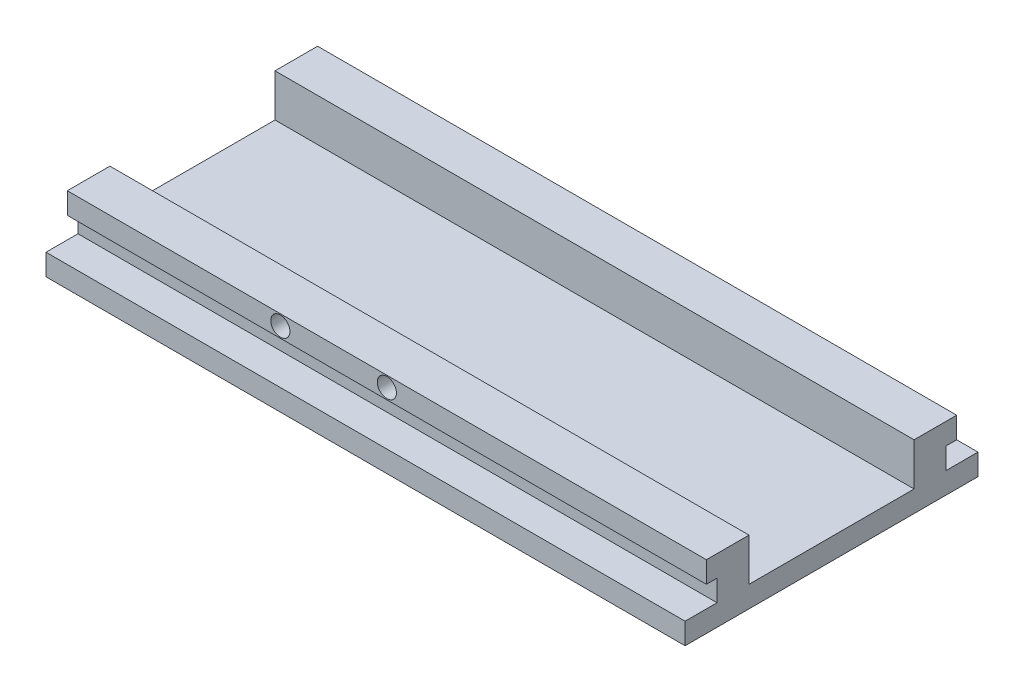
ISO-10303-21;
HEADER;
FILE_DESCRIPTION(('STEP AP214'),'2;1');
FILE_NAME('part.step','',(''),(''),'','','');
FILE_SCHEMA(('AUTOMOTIVE_DESIGN { 1 0 10303 214 1 1 1 1 }'));
ENDSEC;
DATA;
#1=APPLICATION_CONTEXT('core data for automotive mechanical design processes');
#2=APPLICATION_PROTOCOL_DEFINITION('international standard','automotive_design',2000,#1);
#3=PRODUCT_CONTEXT('',#1,'mechanical');
#4=PRODUCT('Part','Part','',(#3));
#5=PRODUCT_RELATED_PRODUCT_CATEGORY('part','',(#4));
#6=PRODUCT_DEFINITION_FORMATION('','',#4);
#7=PRODUCT_DEFINITION_CONTEXT('part definition',#1,'design');
#8=PRODUCT_DEFINITION('design','',#6,#7);
#9=PRODUCT_DEFINITION_SHAPE('','',#8);
#10=(LENGTH_UNIT() NAMED_UNIT(*) SI_UNIT(.MILLI.,.METRE.));
#11=(NAMED_UNIT(*) PLANE_ANGLE_UNIT() SI_UNIT($,.RADIAN.));
#12=(NAMED_UNIT(*) SI_UNIT($,.STERADIAN.) SOLID_ANGLE_UNIT());
#13=UNCERTAINTY_MEASURE_WITH_UNIT(LENGTH_MEASURE(1.E-05),#10,'distance_accuracy_value','');
#14=(GEOMETRIC_REPRESENTATION_CONTEXT(3) GLOBAL_UNCERTAINTY_ASSIGNED_CONTEXT((#13)) GLOBAL_UNIT_ASSIGNED_CONTEXT((#10,
#11,#12)) REPRESENTATION_CONTEXT('',''));
#15=CARTESIAN_POINT('',(0.,0.,0.));
#16=DIRECTION('',(0.,0.,1.));
#17=DIRECTION('',(1.,0.,0.));
#18=AXIS2_PLACEMENT_3D('',#15,#16,#17);
#19=CARTESIAN_POINT('',(1.78418141592922,6.35,-17.7715957964602));
#20=DIRECTION('',(0.,0.,1.));
#21=DIRECTION('',(1.,0.,0.));
#22=AXIS2_PLACEMENT_3D('',#19,#20,#21);
#23=CYLINDRICAL_SURFACE('',#22,1.143);
#24=CARTESIAN_POINT('',(1.78418141592922,6.35,-15.2315707964602));
#25=DIRECTION('',(0.,0.,1.));
#26=DIRECTION('',(1.,0.,0.));
#27=AXIS2_PLACEMENT_3D('',#24,#25,#26);
#28=CIRCLE('',#27,1.143);
#29=CARTESIAN_POINT('',(2.92718141592922,6.35,-15.2315707964602));
#30=VERTEX_POINT('',#29);
#31=EDGE_CURVE('E186',#30,#30,#28,.T.);
#32=ORIENTED_EDGE('',*,*,#31,.F.);
#33=EDGE_LOOP('',(#32));
#34=FACE_BOUND('',#33,.T.);
#35=CARTESIAN_POINT('',(1.78418141592922,6.35,-11.4215707964602));
#36=DIRECTION('',(0.,0.,1.));
#37=DIRECTION('',(1.,0.,0.));
#38=AXIS2_PLACEMENT_3D('',#35,#36,#37);
#39=CIRCLE('',#38,1.143);
#40=CARTESIAN_POINT('',(2.92718141592922,6.35,-11.4215707964602));
#41=VERTEX_POINT('',#40);
#42=EDGE_CURVE('E12',#41,#41,#39,.F.);
#43=ORIENTED_EDGE('',*,*,#42,.F.);
#44=EDGE_LOOP('',(#43));
#45=FACE_BOUND('',#44,.T.);
#46=ADVANCED_FACE('F41',(#34,#45),#23,.F.);
#47=CARTESIAN_POINT('',(-10.9158185840708,6.34999999999997,-17.7715957964602));
#48=DIRECTION('',(0.,0.,1.));
#49=DIRECTION('',(1.,0.,0.));
#50=AXIS2_PLACEMENT_3D('',#47,#48,#49);
#51=CYLINDRICAL_SURFACE('',#50,1.143);
#52=CARTESIAN_POINT('',(-10.9158185840708,6.34999999999997,-15.2315707964602));
#53=DIRECTION('',(0.,0.,1.));
#54=DIRECTION('',(1.,0.,0.));
#55=AXIS2_PLACEMENT_3D('',#52,#53,#54);
#56=CIRCLE('',#55,1.143);
#57=CARTESIAN_POINT('',(-9.77281858407077,6.34999999999997,-15.2315707964602));
#58=VERTEX_POINT('',#57);
#59=EDGE_CURVE('E268',#58,#58,#56,.T.);
#60=ORIENTED_EDGE('',*,*,#59,.F.);
#61=EDGE_LOOP('',(#60));
#62=FACE_BOUND('',#61,.T.);
#63=CARTESIAN_POINT('',(-10.9158185840708,6.34999999999997,-11.4215707964602));
#64=DIRECTION('',(0.,0.,1.));
#65=DIRECTION('',(1.,0.,0.));
#66=AXIS2_PLACEMENT_3D('',#63,#64,#65);
#67=CIRCLE('',#66,1.143);
#68=CARTESIAN_POINT('',(-9.77281858407077,6.34999999999997,-11.4215707964602));
#69=VERTEX_POINT('',#68);
#70=EDGE_CURVE('E45',#69,#69,#67,.F.);
#71=ORIENTED_EDGE('',*,*,#70,.F.);
#72=EDGE_LOOP('',(#71));
#73=FACE_BOUND('',#72,.T.);
#74=ADVANCED_FACE('F387',(#62,#73),#51,.F.);
#75=CARTESIAN_POINT('',(1.78418141592922,6.35,14.6134292035398));
#76=DIRECTION('',(0.,0.,1.));
#77=DIRECTION('',(1.,0.,0.));
#78=AXIS2_PLACEMENT_3D('',#75,#76,#77);
#79=CIRCLE('',#78,1.143);
#80=CARTESIAN_POINT('',(2.92718141592922,6.35,14.6134292035398));
#81=VERTEX_POINT('',#80);
#82=EDGE_CURVE('E189',#81,#81,#79,.T.);
#83=ORIENTED_EDGE('',*,*,#82,.T.);
#84=EDGE_LOOP('',(#83));
#85=FACE_BOUND('',#84,.T.);
#86=CARTESIAN_POINT('',(1.78418141592922,6.35,10.8034292035398));
#87=DIRECTION('',(0.,0.,-1.));
#88=DIRECTION('',(-1.,0.,0.));
#89=AXIS2_PLACEMENT_3D('',#86,#87,#88);
#90=CIRCLE('',#89,1.143);
#91=CARTESIAN_POINT('',(0.641181415929224,6.35,10.8034292035398));
#92=VERTEX_POINT('',#91);
#93=EDGE_CURVE('E273',#92,#92,#90,.F.);
#94=ORIENTED_EDGE('',*,*,#93,.F.);
#95=EDGE_LOOP('',(#94));
#96=FACE_BOUND('',#95,.T.);
#97=ADVANCED_FACE('F390',(#85,#96),#23,.F.);
#98=CARTESIAN_POINT('',(-10.9158185840708,6.34999999999997,14.6134292035398));
#99=DIRECTION('',(0.,0.,1.));
#100=DIRECTION('',(1.,0.,0.));
#101=AXIS2_PLACEMENT_3D('',#98,#99,#100);
#102=CIRCLE('',#101,1.143);
#103=CARTESIAN_POINT('',(-9.77281858407077,6.34999999999997,14.6134292035398));
#104=VERTEX_POINT('',#103);
#105=EDGE_CURVE('E270',#104,#104,#102,.T.);
#106=ORIENTED_EDGE('',*,*,#105,.T.);
#107=EDGE_LOOP('',(#106));
#108=FACE_BOUND('',#107,.T.);
#109=CARTESIAN_POINT('',(-10.9158185840708,6.34999999999997,10.8034292035398));
#110=DIRECTION('',(0.,0.,-1.));
#111=DIRECTION('',(-1.,0.,0.));
#112=AXIS2_PLACEMENT_3D('',#109,#110,#111);
#113=CIRCLE('',#112,1.143);
#114=CARTESIAN_POINT('',(-12.0588185840708,6.34999999999997,10.8034292035398));
#115=VERTEX_POINT('',#114);
#116=EDGE_CURVE('E271',#115,#115,#113,.F.);
#117=ORIENTED_EDGE('',*,*,#116,.F.);
#118=EDGE_LOOP('',(#117));
#119=FACE_BOUND('',#118,.T.);
#120=ADVANCED_FACE('F397',(#108,#119),#51,.F.);
#121=CARTESIAN_POINT('',(-36.3158185840708,7.62,-13.9615707964602));
#122=DIRECTION('',(0.,0.,1.));
#123=DIRECTION('',(1.,0.,0.));
#124=AXIS2_PLACEMENT_3D('',#121,#122,#123);
#125=PLANE('',#124);
#126=DIRECTION('',(-1.,0.,0.));
#127=VECTOR('',#126,1.);
#128=CARTESIAN_POINT('',(-36.3158185840708,5.08,-13.9615707964602));
#129=LINE('',#128,#127);
#130=CARTESIAN_POINT('',(39.8841814159292,5.07999999999999,-13.9615707964602));
#131=VERTEX_POINT('',#130);
#132=CARTESIAN_POINT('',(-36.3158185840708,5.08,-13.9615707964602));
#133=VERTEX_POINT('',#132);
#134=EDGE_CURVE('E184',#131,#133,#129,.T.);
#135=ORIENTED_EDGE('',*,*,#134,.F.);
#136=DIRECTION('',(0.,-1.,0.));
#137=VECTOR('',#136,1.);
#138=CARTESIAN_POINT('',(39.8841814159292,7.62,-13.9615707964602));
#139=LINE('',#138,#137);
#140=CARTESIAN_POINT('',(39.8841814159292,2.54,-13.9615707964602));
#141=VERTEX_POINT('',#140);
#142=EDGE_CURVE('E65',#131,#141,#139,.T.);
#143=ORIENTED_EDGE('',*,*,#142,.T.);
#144=DIRECTION('',(-1.,0.,0.));
#145=VECTOR('',#144,1.);
#146=CARTESIAN_POINT('',(-36.3158185840708,2.54,-13.9615707964602));
#147=LINE('',#146,#145);
#148=CARTESIAN_POINT('',(-36.3158185840708,2.54,-13.9615707964602));
#149=VERTEX_POINT('',#148);
#150=EDGE_CURVE('E169',#141,#149,#147,.T.);
#151=ORIENTED_EDGE('',*,*,#150,.T.);
#152=DIRECTION('',(0.,-1.,0.));
#153=VECTOR('',#152,1.);
#154=CARTESIAN_POINT('',(-36.3158185840708,7.62,-13.9615707964602));
#155=LINE('',#154,#153);
#156=EDGE_CURVE('E236',#133,#149,#155,.T.);
#157=ORIENTED_EDGE('',*,*,#156,.F.);
#158=EDGE_LOOP('',(#135,#143,#151,#157));
#159=FACE_BOUND('',#158,.T.);
#160=ADVANCED_FACE('F374',(#159),#125,.F.);
#161=CARTESIAN_POINT('',(-36.3158185840708,7.62,13.3434292035398));
#162=DIRECTION('',(0.,0.,-1.));
#163=DIRECTION('',(-1.,0.,0.));
#164=AXIS2_PLACEMENT_3D('',#161,#162,#163);
#165=PLANE('',#164);
#166=DIRECTION('',(1.,0.,0.));
#167=VECTOR('',#166,1.);
#168=CARTESIAN_POINT('',(39.8841814159292,5.08,13.3434292035398));
#169=LINE('',#168,#167);
#170=CARTESIAN_POINT('',(-36.3158185840708,5.07999999999999,13.3434292035398));
#171=VERTEX_POINT('',#170);
#172=CARTESIAN_POINT('',(39.8841814159292,5.08,13.3434292035398));
#173=VERTEX_POINT('',#172);
#174=EDGE_CURVE('E198',#171,#173,#169,.T.);
#175=ORIENTED_EDGE('',*,*,#174,.F.);
#176=DIRECTION('',(0.,-1.,0.));
#177=VECTOR('',#176,1.);
#178=CARTESIAN_POINT('',(-36.3158185840708,7.62,13.3434292035398));
#179=LINE('',#178,#177);
#180=CARTESIAN_POINT('',(-36.3158185840708,2.54,13.3434292035398));
#181=VERTEX_POINT('',#180);
#182=EDGE_CURVE('E231',#171,#181,#179,.T.);
#183=ORIENTED_EDGE('',*,*,#182,.T.);
#184=DIRECTION('',(1.,0.,0.));
#185=VECTOR('',#184,1.);
#186=CARTESIAN_POINT('',(-36.3158185840708,2.54,13.3434292035398));
#187=LINE('',#186,#185);
#188=CARTESIAN_POINT('',(39.8841814159292,2.54,13.3434292035398));
#189=VERTEX_POINT('',#188);
#190=EDGE_CURVE('E215',#181,#189,#187,.T.);
#191=ORIENTED_EDGE('',*,*,#190,.T.);
#192=DIRECTION('',(0.,-1.,0.));
#193=VECTOR('',#192,1.);
#194=CARTESIAN_POINT('',(39.8841814159292,7.62,13.3434292035398));
#195=LINE('',#194,#193);
#196=EDGE_CURVE('E229',#173,#189,#195,.T.);
#197=ORIENTED_EDGE('',*,*,#196,.F.);
#198=EDGE_LOOP('',(#175,#183,#191,#197));
#199=FACE_BOUND('',#198,.T.);
#200=ADVANCED_FACE('F350',(#199),#165,.F.);
#201=CARTESIAN_POINT('',(0.,2.54,0.));
#202=DIRECTION('',(0.,1.,0.));
#203=DIRECTION('',(0.,0.,1.));
#204=AXIS2_PLACEMENT_3D('',#201,#202,#203);
#205=PLANE('',#204);
#206=DIRECTION('',(0.,0.,-1.));
#207=VECTOR('',#206,1.);
#208=CARTESIAN_POINT('',(39.8841814159292,2.54,-17.7715707964602));
#209=LINE('',#208,#207);
#210=CARTESIAN_POINT('',(39.8841814159292,2.54,17.1534292035398));
#211=VERTEX_POINT('',#210);
#212=EDGE_CURVE('E330',#211,#189,#209,.T.);
#213=ORIENTED_EDGE('',*,*,#212,.T.);
#214=ORIENTED_EDGE('',*,*,#190,.F.);
#215=DIRECTION('',(0.,0.,1.));
#216=VECTOR('',#215,1.);
#217=CARTESIAN_POINT('',(-36.3158185840708,2.54,-17.7715707964602));
#218=LINE('',#217,#216);
#219=CARTESIAN_POINT('',(-36.3158185840708,2.54,17.1534292035398));
#220=VERTEX_POINT('',#219);
#221=EDGE_CURVE('E300',#181,#220,#218,.T.);
#222=ORIENTED_EDGE('',*,*,#221,.T.);
#223=DIRECTION('',(1.,0.,0.));
#224=VECTOR('',#223,1.);
#225=CARTESIAN_POINT('',(-36.3158185840708,2.54,17.1534292035398));
#226=LINE('',#225,#224);
#227=EDGE_CURVE('E294',#220,#211,#226,.T.);
#228=ORIENTED_EDGE('',*,*,#227,.T.);
#229=EDGE_LOOP('',(#213,#214,#222,#228));
#230=FACE_BOUND('',#229,.T.);
#231=ADVANCED_FACE('F342',(#230),#205,.T.);
#232=CARTESIAN_POINT('',(-36.3158185840708,2.54,-10.1515707964602));
#233=VERTEX_POINT('',#232);
#234=CARTESIAN_POINT('',(-36.3158185840708,2.54,9.53342920353983));
#235=VERTEX_POINT('',#234);
#236=EDGE_CURVE('E295',#233,#235,#218,.T.);
#237=ORIENTED_EDGE('',*,*,#236,.T.);
#238=DIRECTION('',(-1.,0.,0.));
#239=VECTOR('',#238,1.);
#240=CARTESIAN_POINT('',(-36.3158185840708,2.54,9.53342920353983));
#241=LINE('',#240,#239);
#242=CARTESIAN_POINT('',(39.8841814159292,2.54,9.53342920353983));
#243=VERTEX_POINT('',#242);
#244=EDGE_CURVE('E219',#243,#235,#241,.T.);
#245=ORIENTED_EDGE('',*,*,#244,.F.);
#246=CARTESIAN_POINT('',(39.8841814159292,2.54,-10.1515707964602));
#247=VERTEX_POINT('',#246);
#248=EDGE_CURVE('E264',#243,#247,#209,.T.);
#249=ORIENTED_EDGE('',*,*,#248,.T.);
#250=DIRECTION('',(1.,0.,0.));
#251=VECTOR('',#250,1.);
#252=CARTESIAN_POINT('',(-36.3158185840708,2.54,-10.1515707964602));
#253=LINE('',#252,#251);
#254=EDGE_CURVE('E232',#233,#247,#253,.T.);
#255=ORIENTED_EDGE('',*,*,#254,.F.);
#256=EDGE_LOOP('',(#237,#245,#249,#255));
#257=FACE_BOUND('',#256,.T.);
#258=ADVANCED_FACE('F365',(#257),#205,.T.);
#259=ORIENTED_EDGE('',*,*,#150,.F.);
#260=CARTESIAN_POINT('',(39.8841814159292,2.54,-17.7715707964602));
#261=VERTEX_POINT('',#260);
#262=EDGE_CURVE('E245',#141,#261,#209,.T.);
#263=ORIENTED_EDGE('',*,*,#262,.T.);
#264=DIRECTION('',(-1.,0.,0.));
#265=VECTOR('',#264,1.);
#266=CARTESIAN_POINT('',(-36.3158185840708,2.54,-17.7715707964602));
#267=LINE('',#266,#265);
#268=CARTESIAN_POINT('',(-36.3158185840708,2.54,-17.7715707964602));
#269=VERTEX_POINT('',#268);
#270=EDGE_CURVE('E318',#261,#269,#267,.T.);
#271=ORIENTED_EDGE('',*,*,#270,.T.);
#272=EDGE_CURVE('E291',#269,#149,#218,.T.);
#273=ORIENTED_EDGE('',*,*,#272,.T.);
#274=EDGE_LOOP('',(#259,#263,#271,#273));
#275=FACE_BOUND('',#274,.T.);
#276=ADVANCED_FACE('F375',(#275),#205,.T.);
#277=CARTESIAN_POINT('',(-36.3158185840708,2.54,-17.7715707964602));
#278=DIRECTION('',(1.,0.,0.));
#279=DIRECTION('',(0.,0.,-1.));
#280=AXIS2_PLACEMENT_3D('',#277,#278,#279);
#281=PLANE('',#280);
#282=ORIENTED_EDGE('',*,*,#236,.F.);
#283=DIRECTION('',(0.,-1.,0.));
#284=VECTOR('',#283,1.);
#285=CARTESIAN_POINT('',(-36.3158185840708,7.62,-10.1515707964602));
#286=LINE('',#285,#284);
#287=CARTESIAN_POINT('',(-36.3158185840708,7.62,-10.1515707964602));
#288=VERTEX_POINT('',#287);
#289=EDGE_CURVE('E165',#288,#233,#286,.T.);
#290=ORIENTED_EDGE('',*,*,#289,.F.);
#291=DIRECTION('',(0.,0.,1.));
#292=VECTOR('',#291,1.);
#293=CARTESIAN_POINT('',(-36.3158185840708,7.62,-13.9615707964602));
#294=LINE('',#293,#292);
#295=CARTESIAN_POINT('',(-36.3158185840708,7.62,-15.2315707964602));
#296=VERTEX_POINT('',#295);
#297=EDGE_CURVE('E159',#296,#288,#294,.T.);
#298=ORIENTED_EDGE('',*,*,#297,.F.);
#299=DIRECTION('',(0.,1.,0.));
#300=VECTOR('',#299,1.);
#301=CARTESIAN_POINT('',(-36.3158185840708,7.62,-15.2315707964602));
#302=LINE('',#301,#300);
#303=CARTESIAN_POINT('',(-36.3158185840708,5.08,-15.2315707964602));
#304=VERTEX_POINT('',#303);
#305=EDGE_CURVE('E164',#304,#296,#302,.T.);
#306=ORIENTED_EDGE('',*,*,#305,.F.);
#307=DIRECTION('',(0.,0.,1.));
#308=VECTOR('',#307,1.);
#309=CARTESIAN_POINT('',(-36.3158185840708,5.08,-15.2315707964602));
#310=LINE('',#309,#308);
#311=EDGE_CURVE('E193',#304,#133,#310,.T.);
#312=ORIENTED_EDGE('',*,*,#311,.T.);
#313=ORIENTED_EDGE('',*,*,#156,.T.);
#314=ORIENTED_EDGE('',*,*,#272,.F.);
#315=DIRECTION('',(0.,-1.,0.));
#316=VECTOR('',#315,1.);
#317=CARTESIAN_POINT('',(-36.3158185840708,2.54,-17.7715707964602));
#318=LINE('',#317,#316);
#319=CARTESIAN_POINT('',(-36.3158185840708,0.,-17.7715707964602));
#320=VERTEX_POINT('',#319);
#321=EDGE_CURVE('E317',#269,#320,#318,.T.);
#322=ORIENTED_EDGE('',*,*,#321,.T.);
#323=DIRECTION('',(0.,0.,1.));
#324=VECTOR('',#323,1.);
#325=CARTESIAN_POINT('',(-36.3158185840708,0.,-17.7715707964602));
#326=LINE('',#325,#324);
#327=CARTESIAN_POINT('',(-36.3158185840708,0.,17.1534292035398));
#328=VERTEX_POINT('',#327);
#329=EDGE_CURVE('E253',#320,#328,#326,.T.);
#330=ORIENTED_EDGE('',*,*,#329,.T.);
#331=DIRECTION('',(0.,-1.,0.));
#332=VECTOR('',#331,1.);
#333=CARTESIAN_POINT('',(-36.3158185840708,2.54,17.1534292035398));
#334=LINE('',#333,#332);
#335=EDGE_CURVE('E274',#220,#328,#334,.T.);
#336=ORIENTED_EDGE('',*,*,#335,.F.);
#337=ORIENTED_EDGE('',*,*,#221,.F.);
#338=ORIENTED_EDGE('',*,*,#182,.F.);
#339=DIRECTION('',(0.,0.,-1.));
#340=VECTOR('',#339,1.);
#341=CARTESIAN_POINT('',(-36.3158185840708,5.07999999999999,14.6134292035398));
#342=LINE('',#341,#340);
#343=CARTESIAN_POINT('',(-36.3158185840708,5.07999999999999,14.6134292035398));
#344=VERTEX_POINT('',#343);
#345=EDGE_CURVE('E213',#344,#171,#342,.T.);
#346=ORIENTED_EDGE('',*,*,#345,.F.);
#347=DIRECTION('',(0.,-1.,0.));
#348=VECTOR('',#347,1.);
#349=CARTESIAN_POINT('',(-36.3158185840708,7.62,14.6134292035398));
#350=LINE('',#349,#348);
#351=CARTESIAN_POINT('',(-36.3158185840708,7.62,14.6134292035398));
#352=VERTEX_POINT('',#351);
#353=EDGE_CURVE('E205',#352,#344,#350,.T.);
#354=ORIENTED_EDGE('',*,*,#353,.F.);
#355=DIRECTION('',(0.,0.,1.));
#356=VECTOR('',#355,1.);
#357=CARTESIAN_POINT('',(-36.3158185840708,7.62,9.53342920353983));
#358=LINE('',#357,#356);
#359=CARTESIAN_POINT('',(-36.3158185840708,7.62,9.53342920353983));
#360=VERTEX_POINT('',#359);
#361=EDGE_CURVE('E216',#360,#352,#358,.T.);
#362=ORIENTED_EDGE('',*,*,#361,.F.);
#363=DIRECTION('',(0.,-1.,0.));
#364=VECTOR('',#363,1.);
#365=CARTESIAN_POINT('',(-36.3158185840708,7.62,9.53342920353983));
#366=LINE('',#365,#364);
#367=EDGE_CURVE('E223',#360,#235,#366,.T.);
#368=ORIENTED_EDGE('',*,*,#367,.T.);
#369=EDGE_LOOP('',(#282,#290,#298,#306,#312,#313,#314,#322,#330,#336,#337,#338,#346,#354,#362,#368));
#370=FACE_BOUND('',#369,.T.);
#371=ADVANCED_FACE('F43',(#370),#281,.F.);
#372=CARTESIAN_POINT('',(-36.3158185840708,2.54,17.1534292035398));
#373=DIRECTION('',(0.,0.,-1.));
#374=DIRECTION('',(-1.,0.,0.));
#375=AXIS2_PLACEMENT_3D('',#372,#373,#374);
#376=PLANE('',#375);
#377=DIRECTION('',(1.,0.,0.));
#378=VECTOR('',#377,1.);
#379=CARTESIAN_POINT('',(-36.3158185840708,0.,17.1534292035398));
#380=LINE('',#379,#378);
#381=CARTESIAN_POINT('',(39.8841814159292,0.,17.1534292035398));
#382=VERTEX_POINT('',#381);
#383=EDGE_CURVE('E313',#328,#382,#380,.T.);
#384=ORIENTED_EDGE('',*,*,#383,.T.);
#385=DIRECTION('',(0.,-1.,0.));
#386=VECTOR('',#385,1.);
#387=CARTESIAN_POINT('',(39.8841814159292,2.54,17.1534292035398));
#388=LINE('',#387,#386);
#389=EDGE_CURVE('E280',#211,#382,#388,.T.);
#390=ORIENTED_EDGE('',*,*,#389,.F.);
#391=ORIENTED_EDGE('',*,*,#227,.F.);
#392=ORIENTED_EDGE('',*,*,#335,.T.);
#393=EDGE_LOOP('',(#384,#390,#391,#392));
#394=FACE_BOUND('',#393,.T.);
#395=ADVANCED_FACE('F343',(#394),#376,.F.);
#396=CARTESIAN_POINT('',(39.8841814159292,2.54,-17.7715707964602));
#397=DIRECTION('',(-1.,0.,0.));
#398=DIRECTION('',(0.,0.,1.));
#399=AXIS2_PLACEMENT_3D('',#396,#397,#398);
#400=PLANE('',#399);
#401=DIRECTION('',(0.,-1.,0.));
#402=VECTOR('',#401,1.);
#403=CARTESIAN_POINT('',(39.8841814159292,7.62,-10.1515707964602));
#404=LINE('',#403,#402);
#405=CARTESIAN_POINT('',(39.8841814159292,7.62,-10.1515707964602));
#406=VERTEX_POINT('',#405);
#407=EDGE_CURVE('E248',#406,#247,#404,.T.);
#408=ORIENTED_EDGE('',*,*,#407,.T.);
#409=ORIENTED_EDGE('',*,*,#248,.F.);
#410=DIRECTION('',(0.,-1.,0.));
#411=VECTOR('',#410,1.);
#412=CARTESIAN_POINT('',(39.8841814159292,7.62,9.53342920353983));
#413=LINE('',#412,#411);
#414=CARTESIAN_POINT('',(39.8841814159292,7.62,9.53342920353983));
#415=VERTEX_POINT('',#414);
#416=EDGE_CURVE('E57',#415,#243,#413,.T.);
#417=ORIENTED_EDGE('',*,*,#416,.F.);
#418=DIRECTION('',(0.,0.,-1.));
#419=VECTOR('',#418,1.);
#420=CARTESIAN_POINT('',(39.8841814159292,7.62,9.53342920353983));
#421=LINE('',#420,#419);
#422=CARTESIAN_POINT('',(39.8841814159292,7.62,14.6134292035398));
#423=VERTEX_POINT('',#422);
#424=EDGE_CURVE('E218',#423,#415,#421,.T.);
#425=ORIENTED_EDGE('',*,*,#424,.F.);
#426=DIRECTION('',(0.,1.,0.));
#427=VECTOR('',#426,1.);
#428=CARTESIAN_POINT('',(39.8841814159292,7.62,14.6134292035398));
#429=LINE('',#428,#427);
#430=CARTESIAN_POINT('',(39.8841814159292,5.08,14.6134292035398));
#431=VERTEX_POINT('',#430);
#432=EDGE_CURVE('E199',#431,#423,#429,.T.);
#433=ORIENTED_EDGE('',*,*,#432,.F.);
#434=DIRECTION('',(0.,0.,-1.));
#435=VECTOR('',#434,1.);
#436=CARTESIAN_POINT('',(39.8841814159292,5.08,14.6134292035398));
#437=LINE('',#436,#435);
#438=EDGE_CURVE('E209',#431,#173,#437,.T.);
#439=ORIENTED_EDGE('',*,*,#438,.T.);
#440=ORIENTED_EDGE('',*,*,#196,.T.);
#441=ORIENTED_EDGE('',*,*,#212,.F.);
#442=ORIENTED_EDGE('',*,*,#389,.T.);
#443=DIRECTION('',(0.,0.,-1.));
#444=VECTOR('',#443,1.);
#445=CARTESIAN_POINT('',(39.8841814159292,0.,-17.7715707964602));
#446=LINE('',#445,#444);
#447=CARTESIAN_POINT('',(39.8841814159292,0.,-17.7715707964602));
#448=VERTEX_POINT('',#447);
#449=EDGE_CURVE('E306',#382,#448,#446,.T.);
#450=ORIENTED_EDGE('',*,*,#449,.T.);
#451=DIRECTION('',(0.,-1.,0.));
#452=VECTOR('',#451,1.);
#453=CARTESIAN_POINT('',(39.8841814159292,2.54,-17.7715707964602));
#454=LINE('',#453,#452);
#455=EDGE_CURVE('E287',#261,#448,#454,.T.);
#456=ORIENTED_EDGE('',*,*,#455,.F.);
#457=ORIENTED_EDGE('',*,*,#262,.F.);
#458=ORIENTED_EDGE('',*,*,#142,.F.);
#459=DIRECTION('',(0.,0.,1.));
#460=VECTOR('',#459,1.);
#461=CARTESIAN_POINT('',(39.8841814159292,5.07999999999999,-15.2315707964602));
#462=LINE('',#461,#460);
#463=CARTESIAN_POINT('',(39.8841814159292,5.07999999999999,-15.2315707964602));
#464=VERTEX_POINT('',#463);
#465=EDGE_CURVE('E196',#464,#131,#462,.T.);
#466=ORIENTED_EDGE('',*,*,#465,.F.);
#467=DIRECTION('',(0.,-1.,0.));
#468=VECTOR('',#467,1.);
#469=CARTESIAN_POINT('',(39.8841814159292,7.62,-15.2315707964602));
#470=LINE('',#469,#468);
#471=CARTESIAN_POINT('',(39.8841814159292,7.62,-15.2315707964602));
#472=VERTEX_POINT('',#471);
#473=EDGE_CURVE('E178',#472,#464,#470,.T.);
#474=ORIENTED_EDGE('',*,*,#473,.F.);
#475=DIRECTION('',(0.,0.,-1.));
#476=VECTOR('',#475,1.);
#477=CARTESIAN_POINT('',(39.8841814159292,7.62,-13.9615707964602));
#478=LINE('',#477,#476);
#479=EDGE_CURVE('E175',#406,#472,#478,.T.);
#480=ORIENTED_EDGE('',*,*,#479,.F.);
#481=EDGE_LOOP('',(#408,#409,#417,#425,#433,#439,#440,#441,#442,#450,#456,#457,#458,#466,#474,#480));
#482=FACE_BOUND('',#481,.T.);
#483=ADVANCED_FACE('F344',(#482),#400,.F.);
#484=CARTESIAN_POINT('',(-36.3158185840708,2.54,-17.7715707964602));
#485=DIRECTION('',(0.,0.,1.));
#486=DIRECTION('',(1.,0.,0.));
#487=AXIS2_PLACEMENT_3D('',#484,#485,#486);
#488=PLANE('',#487);
#489=DIRECTION('',(-1.,0.,0.));
#490=VECTOR('',#489,1.);
#491=CARTESIAN_POINT('',(-36.3158185840708,0.,-17.7715707964602));
#492=LINE('',#491,#490);
#493=EDGE_CURVE('E301',#448,#320,#492,.T.);
#494=ORIENTED_EDGE('',*,*,#493,.T.);
#495=ORIENTED_EDGE('',*,*,#321,.F.);
#496=ORIENTED_EDGE('',*,*,#270,.F.);
#497=ORIENTED_EDGE('',*,*,#455,.T.);
#498=EDGE_LOOP('',(#494,#495,#496,#497));
#499=FACE_BOUND('',#498,.T.);
#500=ADVANCED_FACE('F321',(#499),#488,.F.);
#501=CARTESIAN_POINT('',(0.,0.,0.));
#502=DIRECTION('',(0.,1.,0.));
#503=DIRECTION('',(0.,0.,1.));
#504=AXIS2_PLACEMENT_3D('',#501,#502,#503);
#505=PLANE('',#504);
#506=ORIENTED_EDGE('',*,*,#329,.F.);
#507=ORIENTED_EDGE('',*,*,#493,.F.);
#508=ORIENTED_EDGE('',*,*,#449,.F.);
#509=ORIENTED_EDGE('',*,*,#383,.F.);
#510=EDGE_LOOP('',(#506,#507,#508,#509));
#511=FACE_BOUND('',#510,.T.);
#512=ADVANCED_FACE('F327',(#511),#505,.F.);
#513=CARTESIAN_POINT('',(-36.3158185840708,7.62,-10.1515707964602));
#514=DIRECTION('',(0.,0.,-1.));
#515=DIRECTION('',(-1.,0.,0.));
#516=AXIS2_PLACEMENT_3D('',#513,#514,#515);
#517=PLANE('',#516);
#518=ORIENTED_EDGE('',*,*,#254,.T.);
#519=ORIENTED_EDGE('',*,*,#407,.F.);
#520=DIRECTION('',(1.,0.,0.));
#521=VECTOR('',#520,1.);
#522=CARTESIAN_POINT('',(-36.3158185840708,7.62,-10.1515707964602));
#523=LINE('',#522,#521);
#524=EDGE_CURVE('E168',#288,#406,#523,.T.);
#525=ORIENTED_EDGE('',*,*,#524,.F.);
#526=ORIENTED_EDGE('',*,*,#289,.T.);
#527=EDGE_LOOP('',(#518,#519,#525,#526));
#528=FACE_BOUND('',#527,.T.);
#529=ADVANCED_FACE('F368',(#528),#517,.F.);
#530=CARTESIAN_POINT('',(0.,7.62,0.));
#531=DIRECTION('',(0.,1.,0.));
#532=DIRECTION('',(0.,0.,1.));
#533=AXIS2_PLACEMENT_3D('',#530,#531,#532);
#534=PLANE('',#533);
#535=ORIENTED_EDGE('',*,*,#479,.T.);
#536=DIRECTION('',(1.,0.,0.));
#537=VECTOR('',#536,1.);
#538=CARTESIAN_POINT('',(-36.3158185840708,7.62,-15.2315707964602));
#539=LINE('',#538,#537);
#540=EDGE_CURVE('E172',#296,#472,#539,.T.);
#541=ORIENTED_EDGE('',*,*,#540,.F.);
#542=ORIENTED_EDGE('',*,*,#297,.T.);
#543=ORIENTED_EDGE('',*,*,#524,.T.);
#544=EDGE_LOOP('',(#535,#541,#542,#543));
#545=FACE_BOUND('',#544,.T.);
#546=ADVANCED_FACE('F173',(#545),#534,.T.);
#547=CARTESIAN_POINT('',(-36.3158185840708,7.62,9.53342920353983));
#548=DIRECTION('',(0.,0.,1.));
#549=DIRECTION('',(1.,0.,0.));
#550=AXIS2_PLACEMENT_3D('',#547,#548,#549);
#551=PLANE('',#550);
#552=ORIENTED_EDGE('',*,*,#244,.T.);
#553=ORIENTED_EDGE('',*,*,#367,.F.);
#554=DIRECTION('',(-1.,0.,0.));
#555=VECTOR('',#554,1.);
#556=CARTESIAN_POINT('',(-36.3158185840708,7.62,9.53342920353983));
#557=LINE('',#556,#555);
#558=EDGE_CURVE('E221',#415,#360,#557,.T.);
#559=ORIENTED_EDGE('',*,*,#558,.F.);
#560=ORIENTED_EDGE('',*,*,#416,.T.);
#561=EDGE_LOOP('',(#552,#553,#559,#560));
#562=FACE_BOUND('',#561,.T.);
#563=ADVANCED_FACE('F364',(#562),#551,.F.);
#564=CARTESIAN_POINT('',(0.,7.62,0.));
#565=DIRECTION('',(0.,1.,0.));
#566=DIRECTION('',(0.,0.,1.));
#567=AXIS2_PLACEMENT_3D('',#564,#565,#566);
#568=PLANE('',#567);
#569=ORIENTED_EDGE('',*,*,#361,.T.);
#570=DIRECTION('',(-1.,0.,0.));
#571=VECTOR('',#570,1.);
#572=CARTESIAN_POINT('',(39.8841814159292,7.62,14.6134292035398));
#573=LINE('',#572,#571);
#574=EDGE_CURVE('E202',#423,#352,#573,.T.);
#575=ORIENTED_EDGE('',*,*,#574,.F.);
#576=ORIENTED_EDGE('',*,*,#424,.T.);
#577=ORIENTED_EDGE('',*,*,#558,.T.);
#578=EDGE_LOOP('',(#569,#575,#576,#577));
#579=FACE_BOUND('',#578,.T.);
#580=ADVANCED_FACE('F362',(#579),#568,.T.);
#581=CARTESIAN_POINT('',(39.8841814159292,5.08,14.6134292035398));
#582=DIRECTION('',(0.,1.,0.));
#583=DIRECTION('',(-1.,0.,0.));
#584=AXIS2_PLACEMENT_3D('',#581,#582,#583);
#585=PLANE('',#584);
#586=ORIENTED_EDGE('',*,*,#174,.T.);
#587=ORIENTED_EDGE('',*,*,#438,.F.);
#588=DIRECTION('',(1.,0.,0.));
#589=VECTOR('',#588,1.);
#590=CARTESIAN_POINT('',(39.8841814159292,5.08,14.6134292035398));
#591=LINE('',#590,#589);
#592=EDGE_CURVE('E207',#344,#431,#591,.T.);
#593=ORIENTED_EDGE('',*,*,#592,.F.);
#594=ORIENTED_EDGE('',*,*,#345,.T.);
#595=EDGE_LOOP('',(#586,#587,#593,#594));
#596=FACE_BOUND('',#595,.T.);
#597=ADVANCED_FACE('F357',(#596),#585,.F.);
#598=CARTESIAN_POINT('',(0.,0.,14.6134292035398));
#599=DIRECTION('',(0.,0.,-1.));
#600=DIRECTION('',(-1.,0.,0.));
#601=AXIS2_PLACEMENT_3D('',#598,#599,#600);
#602=PLANE('',#601);
#603=ORIENTED_EDGE('',*,*,#105,.F.);
#604=EDGE_LOOP('',(#603));
#605=FACE_BOUND('',#604,.T.);
#606=ORIENTED_EDGE('',*,*,#82,.F.);
#607=EDGE_LOOP('',(#606));
#608=FACE_BOUND('',#607,.T.);
#609=ORIENTED_EDGE('',*,*,#432,.T.);
#610=ORIENTED_EDGE('',*,*,#574,.T.);
#611=ORIENTED_EDGE('',*,*,#353,.T.);
#612=ORIENTED_EDGE('',*,*,#592,.T.);
#613=EDGE_LOOP('',(#609,#610,#611,#612));
#614=FACE_BOUND('',#613,.T.);
#615=ADVANCED_FACE('F359',(#605,#608,#614),#602,.F.);
#616=CARTESIAN_POINT('',(-36.3158185840708,5.08,-15.2315707964602));
#617=DIRECTION('',(0.,1.,0.));
#618=DIRECTION('',(-1.,0.,0.));
#619=AXIS2_PLACEMENT_3D('',#616,#617,#618);
#620=PLANE('',#619);
#621=ORIENTED_EDGE('',*,*,#134,.T.);
#622=ORIENTED_EDGE('',*,*,#311,.F.);
#623=DIRECTION('',(-1.,0.,0.));
#624=VECTOR('',#623,1.);
#625=CARTESIAN_POINT('',(-36.3158185840708,5.08,-15.2315707964602));
#626=LINE('',#625,#624);
#627=EDGE_CURVE('E182',#464,#304,#626,.T.);
#628=ORIENTED_EDGE('',*,*,#627,.F.);
#629=ORIENTED_EDGE('',*,*,#465,.T.);
#630=EDGE_LOOP('',(#621,#622,#628,#629));
#631=FACE_BOUND('',#630,.T.);
#632=ADVANCED_FACE('F371',(#631),#620,.F.);
#633=CARTESIAN_POINT('',(0.,0.,-15.2315707964602));
#634=DIRECTION('',(0.,0.,1.));
#635=DIRECTION('',(1.,0.,0.));
#636=AXIS2_PLACEMENT_3D('',#633,#634,#635);
#637=PLANE('',#636);
#638=ORIENTED_EDGE('',*,*,#59,.T.);
#639=EDGE_LOOP('',(#638));
#640=FACE_BOUND('',#639,.T.);
#641=ORIENTED_EDGE('',*,*,#31,.T.);
#642=EDGE_LOOP('',(#641));
#643=FACE_BOUND('',#642,.T.);
#644=ORIENTED_EDGE('',*,*,#305,.T.);
#645=ORIENTED_EDGE('',*,*,#540,.T.);
#646=ORIENTED_EDGE('',*,*,#473,.T.);
#647=ORIENTED_EDGE('',*,*,#627,.T.);
#648=EDGE_LOOP('',(#644,#645,#646,#647));
#649=FACE_BOUND('',#648,.T.);
#650=ADVANCED_FACE('F180',(#640,#643,#649),#637,.F.);
#651=CARTESIAN_POINT('',(0.,0.,10.8034292035398));
#652=DIRECTION('',(0.,0.,-1.));
#653=DIRECTION('',(-1.,0.,0.));
#654=AXIS2_PLACEMENT_3D('',#651,#652,#653);
#655=PLANE('',#654);
#656=ORIENTED_EDGE('',*,*,#116,.T.);
#657=EDGE_LOOP('',(#656));
#658=FACE_BOUND('',#657,.T.);
#659=ADVANCED_FACE('F415',(#658),#655,.F.);
#660=ORIENTED_EDGE('',*,*,#93,.T.);
#661=EDGE_LOOP('',(#660));
#662=FACE_BOUND('',#661,.T.);
#663=ADVANCED_FACE('F412',(#662),#655,.F.);
#664=CARTESIAN_POINT('',(0.,0.,-11.4215707964602));
#665=DIRECTION('',(0.,0.,1.));
#666=DIRECTION('',(1.,0.,0.));
#667=AXIS2_PLACEMENT_3D('',#664,#665,#666);
#668=PLANE('',#667);
#669=ORIENTED_EDGE('',*,*,#70,.T.);
#670=EDGE_LOOP('',(#669));
#671=FACE_BOUND('',#670,.T.);
#672=ADVANCED_FACE('F414',(#671),#668,.F.);
#673=ORIENTED_EDGE('',*,*,#42,.T.);
#674=EDGE_LOOP('',(#673));
#675=FACE_BOUND('',#674,.T.);
#676=ADVANCED_FACE('F421',(#675),#668,.F.);
#677=CLOSED_SHELL('',(#46,#74,#97,#120,#160,#200,#231,#258,#276,#371,#395,#483,#500,#512,#529,
#546,#563,#580,#597,#615,#632,#650,#659,#663,#672,#676));
#678=MANIFOLD_SOLID_BREP('B2',#677);
#679=ADVANCED_BREP_SHAPE_REPRESENTATION('',(#18,#678),#14);
#680=SHAPE_DEFINITION_REPRESENTATION(#9,#679);
ENDSEC;
END-ISO-10303-21;
